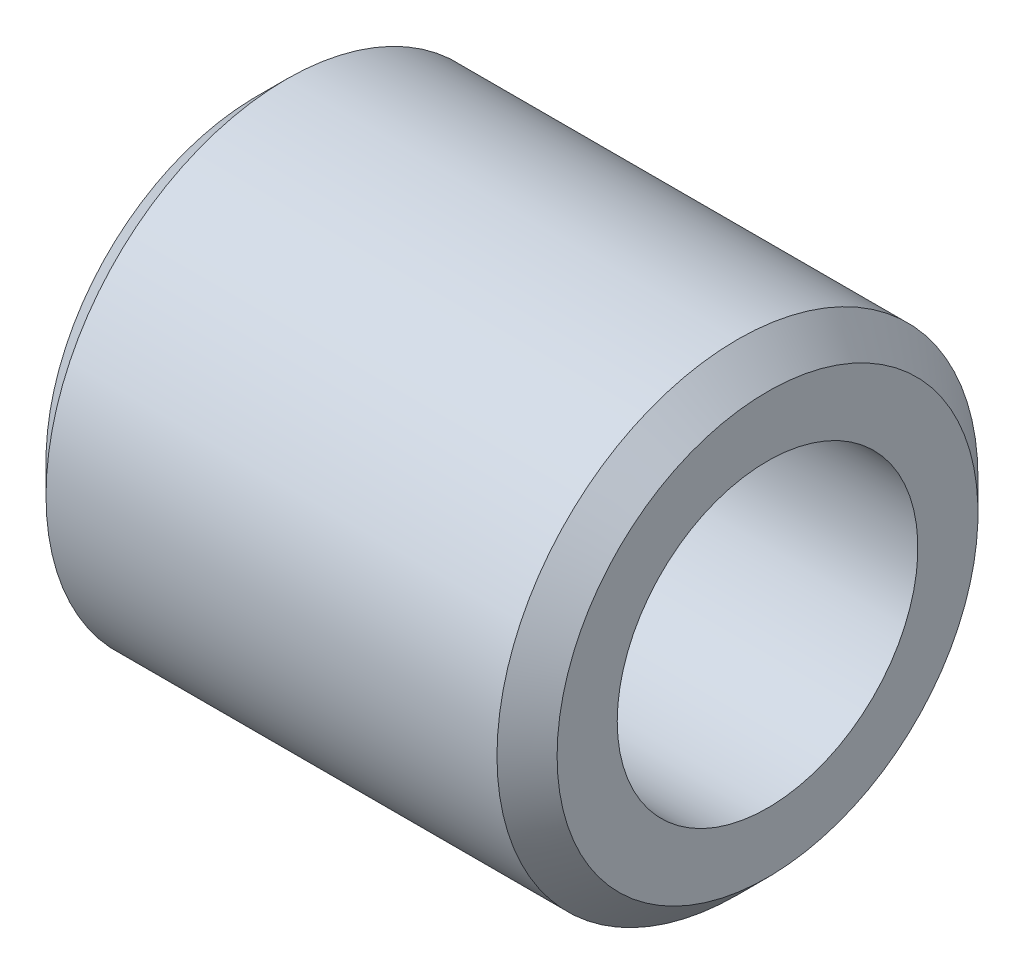
ISO-10303-21;
HEADER;
FILE_DESCRIPTION(('STEP AP214'),'2;1');
FILE_NAME('part.step','',(''),(''),'','','');
FILE_SCHEMA(('AUTOMOTIVE_DESIGN { 1 0 10303 214 1 1 1 1 }'));
ENDSEC;
DATA;
#1=APPLICATION_CONTEXT('core data for automotive mechanical design processes');
#2=APPLICATION_PROTOCOL_DEFINITION('international standard','automotive_design',2000,#1);
#3=PRODUCT_CONTEXT('',#1,'mechanical');
#4=PRODUCT('Part','Part','',(#3));
#5=PRODUCT_RELATED_PRODUCT_CATEGORY('part','',(#4));
#6=PRODUCT_DEFINITION_FORMATION('','',#4);
#7=PRODUCT_DEFINITION_CONTEXT('part definition',#1,'design');
#8=PRODUCT_DEFINITION('design','',#6,#7);
#9=PRODUCT_DEFINITION_SHAPE('','',#8);
#10=(LENGTH_UNIT() NAMED_UNIT(*) SI_UNIT(.MILLI.,.METRE.));
#11=(NAMED_UNIT(*) PLANE_ANGLE_UNIT() SI_UNIT($,.RADIAN.));
#12=(NAMED_UNIT(*) SI_UNIT($,.STERADIAN.) SOLID_ANGLE_UNIT());
#13=UNCERTAINTY_MEASURE_WITH_UNIT(LENGTH_MEASURE(1.E-05),#10,'distance_accuracy_value','');
#14=(GEOMETRIC_REPRESENTATION_CONTEXT(3) GLOBAL_UNCERTAINTY_ASSIGNED_CONTEXT((#13)) GLOBAL_UNIT_ASSIGNED_CONTEXT((#10,
#11,#12)) REPRESENTATION_CONTEXT('',''));
#15=CARTESIAN_POINT('',(0.,0.,0.));
#16=DIRECTION('',(0.,0.,1.));
#17=DIRECTION('',(1.,0.,0.));
#18=AXIS2_PLACEMENT_3D('',#15,#16,#17);
#19=CARTESIAN_POINT('',(4.25,0.,0.));
#20=DIRECTION('',(-1.,0.,0.));
#21=DIRECTION('',(0.,0.,1.));
#22=AXIS2_PLACEMENT_3D('',#19,#20,#21);
#23=CYLINDRICAL_SURFACE('',#22,2.5);
#24=CARTESIAN_POINT('',(-4.25,0.,0.));
#25=DIRECTION('',(-1.,0.,0.));
#26=DIRECTION('',(0.,0.,1.));
#27=AXIS2_PLACEMENT_3D('',#24,#25,#26);
#28=CIRCLE('',#27,2.5);
#29=CARTESIAN_POINT('',(-4.25,0.,2.5));
#30=VERTEX_POINT('',#29);
#31=EDGE_CURVE('E34',#30,#30,#28,.T.);
#32=ORIENTED_EDGE('',*,*,#31,.T.);
#33=EDGE_LOOP('',(#32));
#34=FACE_BOUND('',#33,.T.);
#35=CARTESIAN_POINT('',(4.25,0.,0.));
#36=DIRECTION('',(-1.,0.,0.));
#37=DIRECTION('',(0.,0.,1.));
#38=AXIS2_PLACEMENT_3D('',#35,#36,#37);
#39=CIRCLE('',#38,2.5);
#40=CARTESIAN_POINT('',(4.25,0.,2.5));
#41=VERTEX_POINT('',#40);
#42=EDGE_CURVE('E18',#41,#41,#39,.T.);
#43=ORIENTED_EDGE('',*,*,#42,.F.);
#44=EDGE_LOOP('',(#43));
#45=FACE_BOUND('',#44,.T.);
#46=ADVANCED_FACE('F15',(#34,#45),#23,.F.);
#47=CARTESIAN_POINT('',(4.25,0.,0.));
#48=DIRECTION('',(1.,0.,0.));
#49=DIRECTION('',(0.,0.,-1.));
#50=AXIS2_PLACEMENT_3D('',#47,#48,#49);
#51=PLANE('',#50);
#52=ORIENTED_EDGE('',*,*,#42,.T.);
#53=EDGE_LOOP('',(#52));
#54=FACE_BOUND('',#53,.T.);
#55=CARTESIAN_POINT('',(4.25000000001319,0.,0.));
#56=DIRECTION('',(-1.,0.,0.));
#57=DIRECTION('',(0.,0.,1.));
#58=AXIS2_PLACEMENT_3D('',#55,#56,#57);
#59=CIRCLE('',#58,3.50000000003092);
#60=CARTESIAN_POINT('',(4.25000000001319,0.,3.50000000003092));
#61=VERTEX_POINT('',#60);
#62=EDGE_CURVE('E32',#61,#61,#59,.T.);
#63=ORIENTED_EDGE('',*,*,#62,.F.);
#64=EDGE_LOOP('',(#63));
#65=FACE_BOUND('',#64,.T.);
#66=ADVANCED_FACE('F41',(#54,#65),#51,.T.);
#67=CARTESIAN_POINT('',(-4.25,0.,0.));
#68=DIRECTION('',(1.,0.,0.));
#69=DIRECTION('',(0.,0.,-1.));
#70=AXIS2_PLACEMENT_3D('',#67,#68,#69);
#71=PLANE('',#70);
#72=ORIENTED_EDGE('',*,*,#31,.F.);
#73=EDGE_LOOP('',(#72));
#74=FACE_BOUND('',#73,.T.);
#75=CARTESIAN_POINT('',(-4.25000000001319,0.,0.));
#76=DIRECTION('',(1.,0.,0.));
#77=DIRECTION('',(0.,0.,-1.));
#78=AXIS2_PLACEMENT_3D('',#75,#76,#77);
#79=CIRCLE('',#78,3.49999999997408);
#80=CARTESIAN_POINT('',(-4.25000000001319,0.,-3.49999999997408));
#81=VERTEX_POINT('',#80);
#82=EDGE_CURVE('E27',#81,#81,#79,.T.);
#83=ORIENTED_EDGE('',*,*,#82,.F.);
#84=EDGE_LOOP('',(#83));
#85=FACE_BOUND('',#84,.T.);
#86=ADVANCED_FACE('F49',(#74,#85),#71,.F.);
#87=CARTESIAN_POINT('',(3.74999999996817,0.,0.));
#88=DIRECTION('',(-1.,0.,0.));
#89=DIRECTION('',(0.,0.,1.));
#90=AXIS2_PLACEMENT_3D('',#87,#88,#89);
#91=CONICAL_SURFACE('',#90,4.0000000000191,0.785398163340605);
#92=CARTESIAN_POINT('',(3.75,0.,0.));
#93=DIRECTION('',(-1.,0.,0.));
#94=DIRECTION('',(0.,0.,1.));
#95=AXIS2_PLACEMENT_3D('',#92,#93,#94);
#96=CIRCLE('',#95,4.);
#97=CARTESIAN_POINT('',(3.75,0.,4.));
#98=VERTEX_POINT('',#97);
#99=EDGE_CURVE('E22',#98,#98,#96,.T.);
#100=ORIENTED_EDGE('',*,*,#99,.F.);
#101=EDGE_LOOP('',(#100));
#102=FACE_BOUND('',#101,.T.);
#103=ORIENTED_EDGE('',*,*,#62,.T.);
#104=EDGE_LOOP('',(#103));
#105=FACE_BOUND('',#104,.T.);
#106=ADVANCED_FACE('F57',(#102,#105),#91,.T.);
#107=CARTESIAN_POINT('',(-3.74999999991132,0.,0.));
#108=DIRECTION('',(1.,0.,0.));
#109=DIRECTION('',(0.,0.,-1.));
#110=AXIS2_PLACEMENT_3D('',#107,#108,#109);
#111=CONICAL_SURFACE('',#110,4.0000000000191,0.785398163340605);
#112=CARTESIAN_POINT('',(-3.75,0.,0.));
#113=DIRECTION('',(-1.,0.,0.));
#114=DIRECTION('',(0.,0.,1.));
#115=AXIS2_PLACEMENT_3D('',#112,#113,#114);
#116=CIRCLE('',#115,4.);
#117=CARTESIAN_POINT('',(-3.75,0.,4.));
#118=VERTEX_POINT('',#117);
#119=EDGE_CURVE('E10',#118,#118,#116,.F.);
#120=ORIENTED_EDGE('',*,*,#119,.F.);
#121=EDGE_LOOP('',(#120));
#122=FACE_BOUND('',#121,.T.);
#123=ORIENTED_EDGE('',*,*,#82,.T.);
#124=EDGE_LOOP('',(#123));
#125=FACE_BOUND('',#124,.T.);
#126=ADVANCED_FACE('F52',(#122,#125),#111,.T.);
#127=CARTESIAN_POINT('',(4.25,0.,0.));
#128=DIRECTION('',(-1.,0.,0.));
#129=DIRECTION('',(0.,0.,1.));
#130=AXIS2_PLACEMENT_3D('',#127,#128,#129);
#131=CYLINDRICAL_SURFACE('',#130,4.);
#132=ORIENTED_EDGE('',*,*,#119,.T.);
#133=EDGE_LOOP('',(#132));
#134=FACE_BOUND('',#133,.T.);
#135=ORIENTED_EDGE('',*,*,#99,.T.);
#136=EDGE_LOOP('',(#135));
#137=FACE_BOUND('',#136,.T.);
#138=ADVANCED_FACE('F50',(#134,#137),#131,.T.);
#139=CLOSED_SHELL('',(#46,#66,#86,#106,#126,#138));
#140=MANIFOLD_SOLID_BREP('B1',#139);
#141=ADVANCED_BREP_SHAPE_REPRESENTATION('',(#18,#140),#14);
#142=SHAPE_DEFINITION_REPRESENTATION(#9,#141);
ENDSEC;
END-ISO-10303-21;
